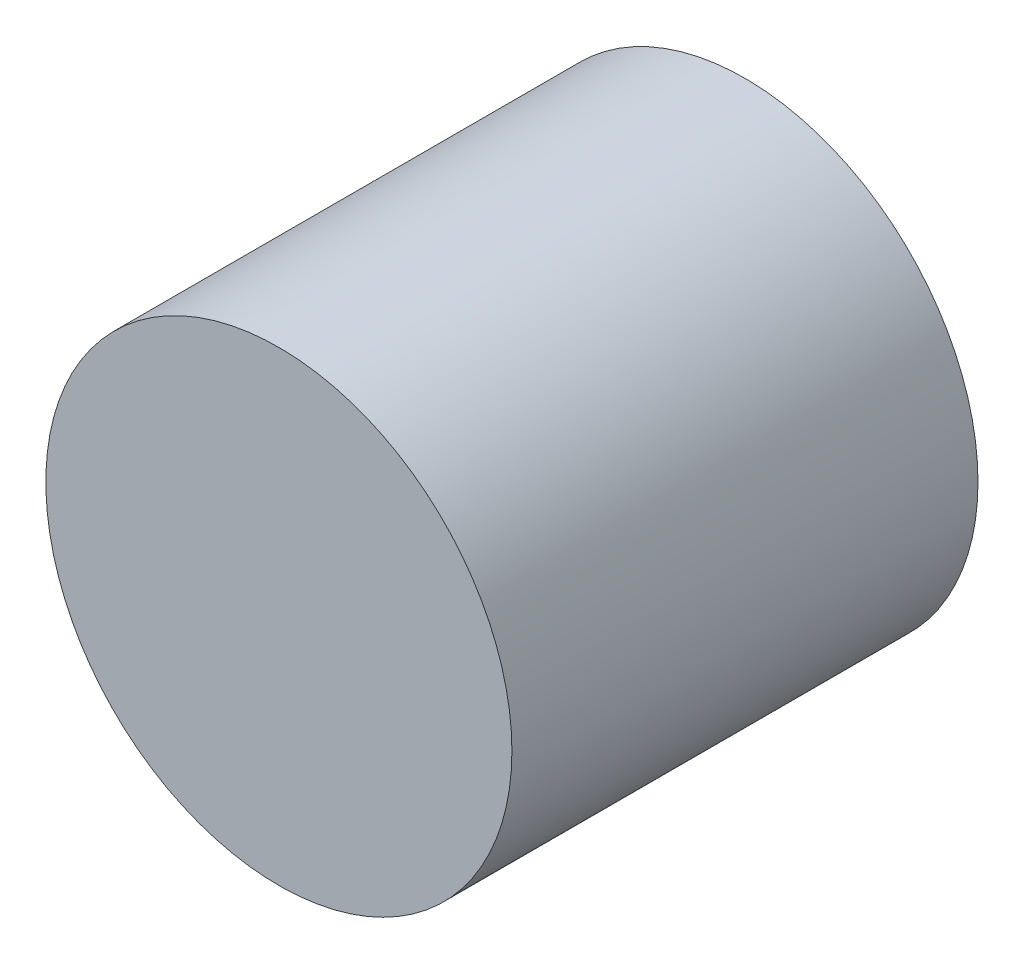
ISO-10303-21;
HEADER;
FILE_DESCRIPTION(('STEP AP214'),'2;1');
FILE_NAME('part.step','',(''),(''),'','','');
FILE_SCHEMA(('AUTOMOTIVE_DESIGN { 1 0 10303 214 1 1 1 1 }'));
ENDSEC;
DATA;
#1=APPLICATION_CONTEXT('core data for automotive mechanical design processes');
#2=APPLICATION_PROTOCOL_DEFINITION('international standard','automotive_design',2000,#1);
#3=PRODUCT_CONTEXT('',#1,'mechanical');
#4=PRODUCT('Part','Part','',(#3));
#5=PRODUCT_RELATED_PRODUCT_CATEGORY('part','',(#4));
#6=PRODUCT_DEFINITION_FORMATION('','',#4);
#7=PRODUCT_DEFINITION_CONTEXT('part definition',#1,'design');
#8=PRODUCT_DEFINITION('design','',#6,#7);
#9=PRODUCT_DEFINITION_SHAPE('','',#8);
#10=(LENGTH_UNIT() NAMED_UNIT(*) SI_UNIT(.MILLI.,.METRE.));
#11=(NAMED_UNIT(*) PLANE_ANGLE_UNIT() SI_UNIT($,.RADIAN.));
#12=(NAMED_UNIT(*) SI_UNIT($,.STERADIAN.) SOLID_ANGLE_UNIT());
#13=UNCERTAINTY_MEASURE_WITH_UNIT(LENGTH_MEASURE(1.E-05),#10,'distance_accuracy_value','');
#14=(GEOMETRIC_REPRESENTATION_CONTEXT(3) GLOBAL_UNCERTAINTY_ASSIGNED_CONTEXT((#13)) GLOBAL_UNIT_ASSIGNED_CONTEXT((#10,
#11,#12)) REPRESENTATION_CONTEXT('',''));
#15=CARTESIAN_POINT('',(0.,0.,0.));
#16=DIRECTION('',(0.,0.,1.));
#17=DIRECTION('',(1.,0.,0.));
#18=AXIS2_PLACEMENT_3D('',#15,#16,#17);
#19=CARTESIAN_POINT('',(0.,0.,100.));
#20=DIRECTION('',(0.,0.,-1.));
#21=DIRECTION('',(-1.,0.,0.));
#22=AXIS2_PLACEMENT_3D('',#19,#20,#21);
#23=CYLINDRICAL_SURFACE('',#22,50.);
#24=CARTESIAN_POINT('',(0.,0.,100.));
#25=DIRECTION('',(0.,0.,1.));
#26=DIRECTION('',(1.,0.,0.));
#27=AXIS2_PLACEMENT_3D('',#24,#25,#26);
#28=CIRCLE('',#27,50.);
#29=CARTESIAN_POINT('',(50.,0.,100.));
#30=VERTEX_POINT('',#29);
#31=EDGE_CURVE('E10',#30,#30,#28,.T.);
#32=ORIENTED_EDGE('',*,*,#31,.F.);
#33=EDGE_LOOP('',(#32));
#34=FACE_BOUND('',#33,.T.);
#35=CARTESIAN_POINT('',(0.,0.,0.));
#36=DIRECTION('',(0.,0.,1.));
#37=DIRECTION('',(1.,0.,0.));
#38=AXIS2_PLACEMENT_3D('',#35,#36,#37);
#39=CIRCLE('',#38,50.);
#40=CARTESIAN_POINT('',(50.,0.,0.));
#41=VERTEX_POINT('',#40);
#42=EDGE_CURVE('E37',#41,#41,#39,.T.);
#43=ORIENTED_EDGE('',*,*,#42,.T.);
#44=EDGE_LOOP('',(#43));
#45=FACE_BOUND('',#44,.T.);
#46=ADVANCED_FACE('F34',(#34,#45),#23,.T.);
#47=CARTESIAN_POINT('',(0.,0.,100.));
#48=DIRECTION('',(0.,0.,1.));
#49=DIRECTION('',(1.,0.,0.));
#50=AXIS2_PLACEMENT_3D('',#47,#48,#49);
#51=PLANE('',#50);
#52=ORIENTED_EDGE('',*,*,#31,.T.);
#53=EDGE_LOOP('',(#52));
#54=FACE_BOUND('',#53,.T.);
#55=ADVANCED_FACE('F49',(#54),#51,.T.);
#56=CARTESIAN_POINT('',(0.,0.,0.));
#57=DIRECTION('',(0.,0.,1.));
#58=DIRECTION('',(1.,0.,0.));
#59=AXIS2_PLACEMENT_3D('',#56,#57,#58);
#60=PLANE('',#59);
#61=ORIENTED_EDGE('',*,*,#42,.F.);
#62=EDGE_LOOP('',(#61));
#63=FACE_BOUND('',#62,.T.);
#64=ADVANCED_FACE('F47',(#63),#60,.F.);
#65=CLOSED_SHELL('',(#46,#55,#64));
#66=MANIFOLD_SOLID_BREP('B2',#65);
#67=ADVANCED_BREP_SHAPE_REPRESENTATION('',(#18,#66),#14);
#68=SHAPE_DEFINITION_REPRESENTATION(#9,#67);
ENDSEC;
END-ISO-10303-21;
